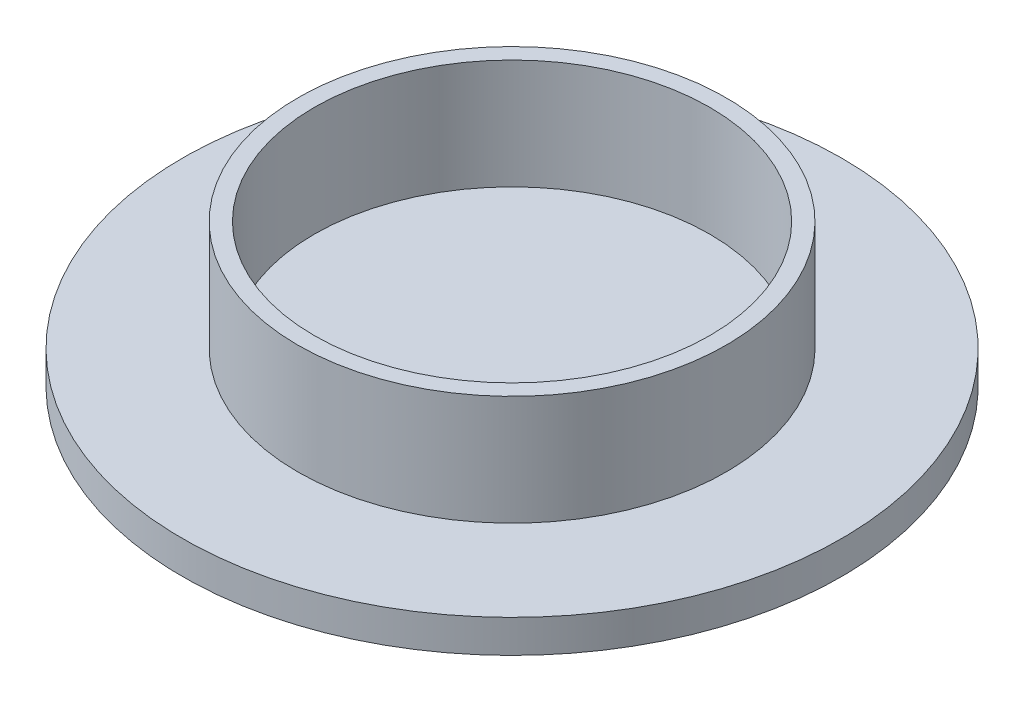
ISO-10303-21;
HEADER;
FILE_DESCRIPTION(('STEP AP214'),'2;1');
FILE_NAME('part.step','',(''),(''),'','','');
FILE_SCHEMA(('AUTOMOTIVE_DESIGN { 1 0 10303 214 1 1 1 1 }'));
ENDSEC;
DATA;
#1=APPLICATION_CONTEXT('core data for automotive mechanical design processes');
#2=APPLICATION_PROTOCOL_DEFINITION('international standard','automotive_design',2000,#1);
#3=PRODUCT_CONTEXT('',#1,'mechanical');
#4=PRODUCT('Part','Part','',(#3));
#5=PRODUCT_RELATED_PRODUCT_CATEGORY('part','',(#4));
#6=PRODUCT_DEFINITION_FORMATION('','',#4);
#7=PRODUCT_DEFINITION_CONTEXT('part definition',#1,'design');
#8=PRODUCT_DEFINITION('design','',#6,#7);
#9=PRODUCT_DEFINITION_SHAPE('','',#8);
#10=(LENGTH_UNIT() NAMED_UNIT(*) SI_UNIT(.MILLI.,.METRE.));
#11=(NAMED_UNIT(*) PLANE_ANGLE_UNIT() SI_UNIT($,.RADIAN.));
#12=(NAMED_UNIT(*) SI_UNIT($,.STERADIAN.) SOLID_ANGLE_UNIT());
#13=UNCERTAINTY_MEASURE_WITH_UNIT(LENGTH_MEASURE(1.E-05),#10,'distance_accuracy_value','');
#14=(GEOMETRIC_REPRESENTATION_CONTEXT(3) GLOBAL_UNCERTAINTY_ASSIGNED_CONTEXT((#13)) GLOBAL_UNIT_ASSIGNED_CONTEXT((#10,
#11,#12)) REPRESENTATION_CONTEXT('',''));
#15=CARTESIAN_POINT('',(0.,0.,0.));
#16=DIRECTION('',(0.,0.,1.));
#17=DIRECTION('',(1.,0.,0.));
#18=AXIS2_PLACEMENT_3D('',#15,#16,#17);
#19=CARTESIAN_POINT('',(0.,10.,0.));
#20=DIRECTION('',(0.,1.,0.));
#21=DIRECTION('',(0.,0.,1.));
#22=AXIS2_PLACEMENT_3D('',#19,#20,#21);
#23=PLANE('',#22);
#24=CARTESIAN_POINT('',(0.,10.,0.));
#25=DIRECTION('',(0.,1.,0.));
#26=DIRECTION('',(0.,0.,1.));
#27=AXIS2_PLACEMENT_3D('',#24,#25,#26);
#28=CIRCLE('',#27,19.5);
#29=CARTESIAN_POINT('',(0.,10.,19.5));
#30=VERTEX_POINT('',#29);
#31=EDGE_CURVE('E10',#30,#30,#28,.T.);
#32=ORIENTED_EDGE('',*,*,#31,.T.);
#33=EDGE_LOOP('',(#32));
#34=FACE_BOUND('',#33,.T.);
#35=CARTESIAN_POINT('',(0.,10.,0.));
#36=DIRECTION('',(0.,1.,0.));
#37=DIRECTION('',(0.,0.,1.));
#38=AXIS2_PLACEMENT_3D('',#35,#36,#37);
#39=CIRCLE('',#38,18.);
#40=CARTESIAN_POINT('',(0.,10.,18.));
#41=VERTEX_POINT('',#40);
#42=EDGE_CURVE('E46',#41,#41,#39,.T.);
#43=ORIENTED_EDGE('',*,*,#42,.F.);
#44=EDGE_LOOP('',(#43));
#45=FACE_BOUND('',#44,.T.);
#46=ADVANCED_FACE('F37',(#34,#45),#23,.T.);
#47=CARTESIAN_POINT('',(0.,10.,0.));
#48=DIRECTION('',(0.,-1.,0.));
#49=DIRECTION('',(0.,0.,-1.));
#50=AXIS2_PLACEMENT_3D('',#47,#48,#49);
#51=CYLINDRICAL_SURFACE('',#50,19.5);
#52=ORIENTED_EDGE('',*,*,#31,.F.);
#53=EDGE_LOOP('',(#52));
#54=FACE_BOUND('',#53,.T.);
#55=CARTESIAN_POINT('',(0.,0.,0.));
#56=DIRECTION('',(0.,1.,0.));
#57=DIRECTION('',(0.,0.,1.));
#58=AXIS2_PLACEMENT_3D('',#55,#56,#57);
#59=CIRCLE('',#58,19.5);
#60=CARTESIAN_POINT('',(0.,0.,19.5));
#61=VERTEX_POINT('',#60);
#62=EDGE_CURVE('E41',#61,#61,#59,.T.);
#63=ORIENTED_EDGE('',*,*,#62,.T.);
#64=EDGE_LOOP('',(#63));
#65=FACE_BOUND('',#64,.T.);
#66=ADVANCED_FACE('F39',(#54,#65),#51,.T.);
#67=CARTESIAN_POINT('',(0.,10.,0.));
#68=DIRECTION('',(0.,-1.,0.));
#69=DIRECTION('',(0.,0.,-1.));
#70=AXIS2_PLACEMENT_3D('',#67,#68,#69);
#71=CYLINDRICAL_SURFACE('',#70,18.);
#72=ORIENTED_EDGE('',*,*,#42,.T.);
#73=EDGE_LOOP('',(#72));
#74=FACE_BOUND('',#73,.T.);
#75=CARTESIAN_POINT('',(0.,0.,0.));
#76=DIRECTION('',(0.,1.,0.));
#77=DIRECTION('',(0.,0.,1.));
#78=AXIS2_PLACEMENT_3D('',#75,#76,#77);
#79=CIRCLE('',#78,18.);
#80=CARTESIAN_POINT('',(0.,0.,18.));
#81=VERTEX_POINT('',#80);
#82=EDGE_CURVE('E51',#81,#81,#79,.T.);
#83=ORIENTED_EDGE('',*,*,#82,.F.);
#84=EDGE_LOOP('',(#83));
#85=FACE_BOUND('',#84,.T.);
#86=ADVANCED_FACE('F88',(#74,#85),#71,.F.);
#87=CARTESIAN_POINT('',(0.,0.,0.));
#88=DIRECTION('',(0.,-1.,0.));
#89=DIRECTION('',(0.,0.,-1.));
#90=AXIS2_PLACEMENT_3D('',#87,#88,#89);
#91=PLANE('',#90);
#92=ORIENTED_EDGE('',*,*,#82,.T.);
#93=EDGE_LOOP('',(#92));
#94=FACE_BOUND('',#93,.T.);
#95=ADVANCED_FACE('F76',(#94),#91,.F.);
#96=CARTESIAN_POINT('',(0.,-3.,0.));
#97=DIRECTION('',(0.,1.,0.));
#98=DIRECTION('',(0.,0.,1.));
#99=AXIS2_PLACEMENT_3D('',#96,#97,#98);
#100=CYLINDRICAL_SURFACE('',#99,30.);
#101=CARTESIAN_POINT('',(0.,-3.,0.));
#102=DIRECTION('',(0.,-1.,0.));
#103=DIRECTION('',(0.,0.,-1.));
#104=AXIS2_PLACEMENT_3D('',#101,#102,#103);
#105=CIRCLE('',#104,30.);
#106=CARTESIAN_POINT('',(0.,-3.,-30.));
#107=VERTEX_POINT('',#106);
#108=EDGE_CURVE('E61',#107,#107,#105,.T.);
#109=ORIENTED_EDGE('',*,*,#108,.F.);
#110=EDGE_LOOP('',(#109));
#111=FACE_BOUND('',#110,.T.);
#112=CARTESIAN_POINT('',(0.,0.,0.));
#113=DIRECTION('',(0.,-1.,0.));
#114=DIRECTION('',(0.,0.,-1.));
#115=AXIS2_PLACEMENT_3D('',#112,#113,#114);
#116=CIRCLE('',#115,30.);
#117=CARTESIAN_POINT('',(0.,0.,-30.));
#118=VERTEX_POINT('',#117);
#119=EDGE_CURVE('E57',#118,#118,#116,.T.);
#120=ORIENTED_EDGE('',*,*,#119,.T.);
#121=EDGE_LOOP('',(#120));
#122=FACE_BOUND('',#121,.T.);
#123=ADVANCED_FACE('F79',(#111,#122),#100,.T.);
#124=CARTESIAN_POINT('',(0.,-3.,0.));
#125=DIRECTION('',(0.,-1.,0.));
#126=DIRECTION('',(0.,0.,-1.));
#127=AXIS2_PLACEMENT_3D('',#124,#125,#126);
#128=PLANE('',#127);
#129=ORIENTED_EDGE('',*,*,#108,.T.);
#130=EDGE_LOOP('',(#129));
#131=FACE_BOUND('',#130,.T.);
#132=ADVANCED_FACE('F74',(#131),#128,.T.);
#133=ORIENTED_EDGE('',*,*,#62,.F.);
#134=EDGE_LOOP('',(#133));
#135=FACE_BOUND('',#134,.T.);
#136=ORIENTED_EDGE('',*,*,#119,.F.);
#137=EDGE_LOOP('',(#136));
#138=FACE_BOUND('',#137,.T.);
#139=ADVANCED_FACE('F71',(#135,#138),#91,.F.);
#140=CLOSED_SHELL('',(#46,#66,#86,#95,#123,#132,#139));
#141=MANIFOLD_SOLID_BREP('B2',#140);
#142=ADVANCED_BREP_SHAPE_REPRESENTATION('',(#18,#141),#14);
#143=SHAPE_DEFINITION_REPRESENTATION(#9,#142);
ENDSEC;
END-ISO-10303-21;
